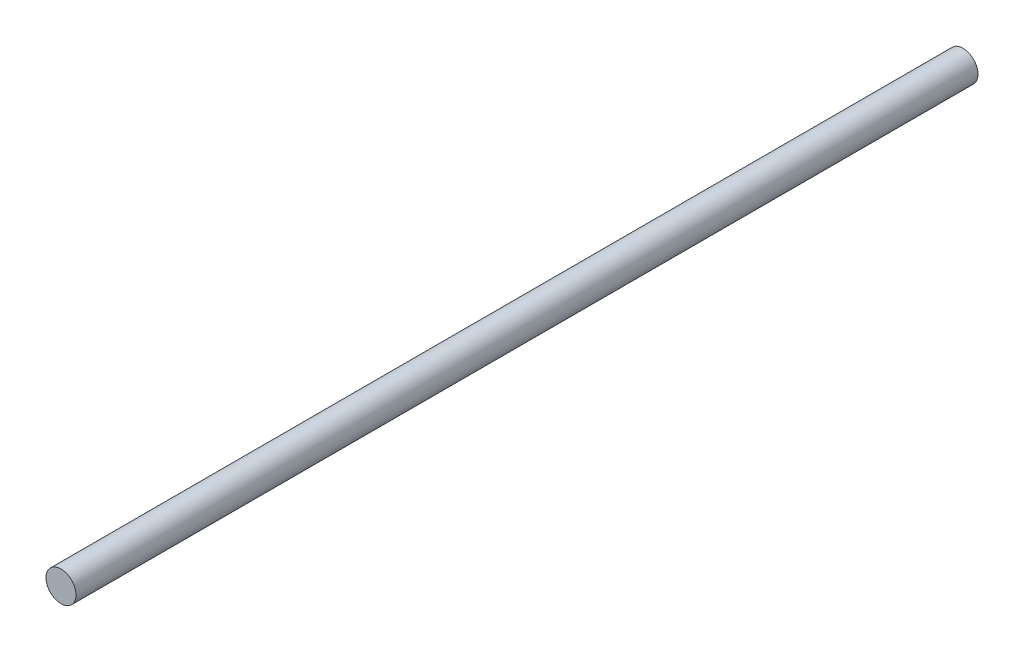
ISO-10303-21;
HEADER;
FILE_DESCRIPTION(('STEP AP214'),'2;1');
FILE_NAME('part.step','',(''),(''),'','','');
FILE_SCHEMA(('AUTOMOTIVE_DESIGN { 1 0 10303 214 1 1 1 1 }'));
ENDSEC;
DATA;
#1=APPLICATION_CONTEXT('core data for automotive mechanical design processes');
#2=APPLICATION_PROTOCOL_DEFINITION('international standard','automotive_design',2000,#1);
#3=PRODUCT_CONTEXT('',#1,'mechanical');
#4=PRODUCT('Part','Part','',(#3));
#5=PRODUCT_RELATED_PRODUCT_CATEGORY('part','',(#4));
#6=PRODUCT_DEFINITION_FORMATION('','',#4);
#7=PRODUCT_DEFINITION_CONTEXT('part definition',#1,'design');
#8=PRODUCT_DEFINITION('design','',#6,#7);
#9=PRODUCT_DEFINITION_SHAPE('','',#8);
#10=(LENGTH_UNIT() NAMED_UNIT(*) SI_UNIT(.MILLI.,.METRE.));
#11=(NAMED_UNIT(*) PLANE_ANGLE_UNIT() SI_UNIT($,.RADIAN.));
#12=(NAMED_UNIT(*) SI_UNIT($,.STERADIAN.) SOLID_ANGLE_UNIT());
#13=UNCERTAINTY_MEASURE_WITH_UNIT(LENGTH_MEASURE(1.E-05),#10,'distance_accuracy_value','');
#14=(GEOMETRIC_REPRESENTATION_CONTEXT(3) GLOBAL_UNCERTAINTY_ASSIGNED_CONTEXT((#13)) GLOBAL_UNIT_ASSIGNED_CONTEXT((#10,
#11,#12)) REPRESENTATION_CONTEXT('',''));
#15=CARTESIAN_POINT('',(0.,0.,0.));
#16=DIRECTION('',(0.,0.,1.));
#17=DIRECTION('',(1.,0.,0.));
#18=AXIS2_PLACEMENT_3D('',#15,#16,#17);
#19=CARTESIAN_POINT('',(0.,0.,762.));
#20=DIRECTION('',(0.,0.,-1.));
#21=DIRECTION('',(-1.,0.,0.));
#22=AXIS2_PLACEMENT_3D('',#19,#20,#21);
#23=CYLINDRICAL_SURFACE('',#22,12.7);
#24=CARTESIAN_POINT('',(0.,0.,762.));
#25=DIRECTION('',(0.,0.,1.));
#26=DIRECTION('',(1.,0.,0.));
#27=AXIS2_PLACEMENT_3D('',#24,#25,#26);
#28=CIRCLE('',#27,12.7);
#29=CARTESIAN_POINT('',(12.7,0.,762.));
#30=VERTEX_POINT('',#29);
#31=EDGE_CURVE('E10',#30,#30,#28,.T.);
#32=ORIENTED_EDGE('',*,*,#31,.F.);
#33=EDGE_LOOP('',(#32));
#34=FACE_BOUND('',#33,.T.);
#35=CARTESIAN_POINT('',(0.,0.,0.));
#36=DIRECTION('',(0.,0.,1.));
#37=DIRECTION('',(1.,0.,0.));
#38=AXIS2_PLACEMENT_3D('',#35,#36,#37);
#39=CIRCLE('',#38,12.7);
#40=CARTESIAN_POINT('',(12.7,0.,0.));
#41=VERTEX_POINT('',#40);
#42=EDGE_CURVE('E36',#41,#41,#39,.T.);
#43=ORIENTED_EDGE('',*,*,#42,.T.);
#44=EDGE_LOOP('',(#43));
#45=FACE_BOUND('',#44,.T.);
#46=ADVANCED_FACE('F33',(#34,#45),#23,.T.);
#47=CARTESIAN_POINT('',(0.,0.,762.));
#48=DIRECTION('',(0.,0.,1.));
#49=DIRECTION('',(1.,0.,0.));
#50=AXIS2_PLACEMENT_3D('',#47,#48,#49);
#51=PLANE('',#50);
#52=ORIENTED_EDGE('',*,*,#31,.T.);
#53=EDGE_LOOP('',(#52));
#54=FACE_BOUND('',#53,.T.);
#55=ADVANCED_FACE('F48',(#54),#51,.T.);
#56=CARTESIAN_POINT('',(0.,0.,0.));
#57=DIRECTION('',(0.,0.,1.));
#58=DIRECTION('',(1.,0.,0.));
#59=AXIS2_PLACEMENT_3D('',#56,#57,#58);
#60=PLANE('',#59);
#61=ORIENTED_EDGE('',*,*,#42,.F.);
#62=EDGE_LOOP('',(#61));
#63=FACE_BOUND('',#62,.T.);
#64=ADVANCED_FACE('F46',(#63),#60,.F.);
#65=CLOSED_SHELL('',(#46,#55,#64));
#66=MANIFOLD_SOLID_BREP('B2',#65);
#67=ADVANCED_BREP_SHAPE_REPRESENTATION('',(#18,#66),#14);
#68=SHAPE_DEFINITION_REPRESENTATION(#9,#67);
ENDSEC;
END-ISO-10303-21;
